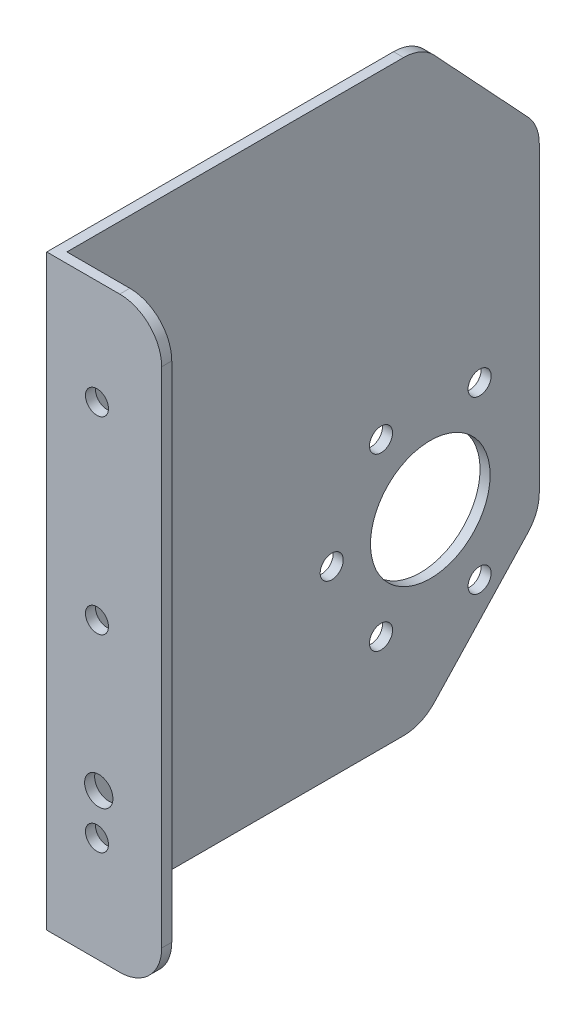
ISO-10303-21;
HEADER;
FILE_DESCRIPTION(('STEP AP214'),'2;1');
FILE_NAME('part.step','',(''),(''),'','','');
FILE_SCHEMA(('AUTOMOTIVE_DESIGN { 1 0 10303 214 1 1 1 1 }'));
ENDSEC;
DATA;
#1=APPLICATION_CONTEXT('core data for automotive mechanical design processes');
#2=APPLICATION_PROTOCOL_DEFINITION('international standard','automotive_design',2000,#1);
#3=PRODUCT_CONTEXT('',#1,'mechanical');
#4=PRODUCT('Part','Part','',(#3));
#5=PRODUCT_RELATED_PRODUCT_CATEGORY('part','',(#4));
#6=PRODUCT_DEFINITION_FORMATION('','',#4);
#7=PRODUCT_DEFINITION_CONTEXT('part definition',#1,'design');
#8=PRODUCT_DEFINITION('design','',#6,#7);
#9=PRODUCT_DEFINITION_SHAPE('','',#8);
#10=(LENGTH_UNIT() NAMED_UNIT(*) SI_UNIT(.MILLI.,.METRE.));
#11=(NAMED_UNIT(*) PLANE_ANGLE_UNIT() SI_UNIT($,.RADIAN.));
#12=(NAMED_UNIT(*) SI_UNIT($,.STERADIAN.) SOLID_ANGLE_UNIT());
#13=UNCERTAINTY_MEASURE_WITH_UNIT(LENGTH_MEASURE(1.E-05),#10,'distance_accuracy_value','');
#14=(GEOMETRIC_REPRESENTATION_CONTEXT(3) GLOBAL_UNCERTAINTY_ASSIGNED_CONTEXT((#13)) GLOBAL_UNIT_ASSIGNED_CONTEXT((#10,
#11,#12)) REPRESENTATION_CONTEXT('',''));
#15=CARTESIAN_POINT('',(0.,0.,0.));
#16=DIRECTION('',(0.,0.,1.));
#17=DIRECTION('',(1.,0.,0.));
#18=AXIS2_PLACEMENT_3D('',#15,#16,#17);
#19=CARTESIAN_POINT('',(2.4,0.,0.));
#20=DIRECTION('',(0.,0.,-1.));
#21=DIRECTION('',(0.,1.,0.));
#22=AXIS2_PLACEMENT_3D('',#19,#20,#21);
#23=PLANE('',#22);
#24=CARTESIAN_POINT('',(12.4,-105.,0.));
#25=DIRECTION('',(0.,0.,1.));
#26=DIRECTION('',(1.,0.,0.));
#27=AXIS2_PLACEMENT_3D('',#24,#25,#26);
#28=CIRCLE('',#27,3.375);
#29=CARTESIAN_POINT('',(15.775,-105.,0.));
#30=VERTEX_POINT('',#29);
#31=EDGE_CURVE('E557',#30,#30,#28,.T.);
#32=ORIENTED_EDGE('',*,*,#31,.F.);
#33=EDGE_LOOP('',(#32));
#34=FACE_BOUND('',#33,.T.);
#35=CARTESIAN_POINT('',(11.9749835807568,-115.,0.));
#36=DIRECTION('',(0.,0.,1.));
#37=DIRECTION('',(1.,0.,0.));
#38=AXIS2_PLACEMENT_3D('',#35,#36,#37);
#39=CIRCLE('',#38,2.75);
#40=CARTESIAN_POINT('',(14.7249835807568,-115.,0.));
#41=VERTEX_POINT('',#40);
#42=EDGE_CURVE('E593',#41,#41,#39,.T.);
#43=ORIENTED_EDGE('',*,*,#42,.F.);
#44=EDGE_LOOP('',(#43));
#45=FACE_BOUND('',#44,.T.);
#46=CARTESIAN_POINT('',(11.9749835807568,-25.,0.));
#47=DIRECTION('',(0.,0.,1.));
#48=DIRECTION('',(1.,0.,0.));
#49=AXIS2_PLACEMENT_3D('',#46,#47,#48);
#50=CIRCLE('',#49,2.75);
#51=CARTESIAN_POINT('',(14.7249835807568,-25.,0.));
#52=VERTEX_POINT('',#51);
#53=EDGE_CURVE('E596',#52,#52,#50,.T.);
#54=ORIENTED_EDGE('',*,*,#53,.F.);
#55=EDGE_LOOP('',(#54));
#56=FACE_BOUND('',#55,.T.);
#57=CARTESIAN_POINT('',(11.9749835807568,-70.,0.));
#58=DIRECTION('',(0.,0.,1.));
#59=DIRECTION('',(1.,0.,0.));
#60=AXIS2_PLACEMENT_3D('',#57,#58,#59);
#61=CIRCLE('',#60,2.75);
#62=CARTESIAN_POINT('',(14.7249835807568,-70.,0.));
#63=VERTEX_POINT('',#62);
#64=EDGE_CURVE('E256',#63,#63,#61,.T.);
#65=ORIENTED_EDGE('',*,*,#64,.F.);
#66=EDGE_LOOP('',(#65));
#67=FACE_BOUND('',#66,.T.);
#68=DIRECTION('',(-1.,0.,0.));
#69=VECTOR('',#68,1.);
#70=CARTESIAN_POINT('',(2.4,-140.,0.));
#71=LINE('',#70,#69);
#72=CARTESIAN_POINT('',(17.4,-140.,0.));
#73=VERTEX_POINT('',#72);
#74=CARTESIAN_POINT('',(0.,-140.,0.));
#75=VERTEX_POINT('',#74);
#76=EDGE_CURVE('E202',#73,#75,#71,.T.);
#77=ORIENTED_EDGE('',*,*,#76,.F.);
#78=CARTESIAN_POINT('',(17.4,-130.,0.));
#79=DIRECTION('',(0.,0.,-1.));
#80=DIRECTION('',(0.,1.,0.));
#81=AXIS2_PLACEMENT_3D('',#78,#79,#80);
#82=CIRCLE('',#81,10.);
#83=CARTESIAN_POINT('',(27.4,-130.,0.));
#84=VERTEX_POINT('',#83);
#85=EDGE_CURVE('E48',#73,#84,#82,.F.);
#86=ORIENTED_EDGE('',*,*,#85,.T.);
#87=DIRECTION('',(0.,-1.,0.));
#88=VECTOR('',#87,1.);
#89=CARTESIAN_POINT('',(27.4,-140.,0.));
#90=LINE('',#89,#88);
#91=CARTESIAN_POINT('',(27.4,-10.,0.));
#92=VERTEX_POINT('',#91);
#93=EDGE_CURVE('E167',#92,#84,#90,.T.);
#94=ORIENTED_EDGE('',*,*,#93,.F.);
#95=CARTESIAN_POINT('',(17.4,-10.,0.));
#96=DIRECTION('',(0.,0.,-1.));
#97=DIRECTION('',(0.,1.,0.));
#98=AXIS2_PLACEMENT_3D('',#95,#96,#97);
#99=CIRCLE('',#98,10.);
#100=CARTESIAN_POINT('',(17.4,0.,0.));
#101=VERTEX_POINT('',#100);
#102=EDGE_CURVE('E57',#92,#101,#99,.F.);
#103=ORIENTED_EDGE('',*,*,#102,.T.);
#104=DIRECTION('',(-1.,0.,0.));
#105=VECTOR('',#104,1.);
#106=CARTESIAN_POINT('',(2.4,0.,0.));
#107=LINE('',#106,#105);
#108=CARTESIAN_POINT('',(0.,0.,0.));
#109=VERTEX_POINT('',#108);
#110=EDGE_CURVE('E161',#101,#109,#107,.T.);
#111=ORIENTED_EDGE('',*,*,#110,.T.);
#112=DIRECTION('',(0.,-1.,0.));
#113=VECTOR('',#112,1.);
#114=CARTESIAN_POINT('',(0.,0.,0.));
#115=LINE('',#114,#113);
#116=EDGE_CURVE('E176',#109,#75,#115,.T.);
#117=ORIENTED_EDGE('',*,*,#116,.T.);
#118=EDGE_LOOP('',(#77,#86,#94,#103,#111,#117));
#119=FACE_BOUND('',#118,.T.);
#120=ADVANCED_FACE('F39',(#34,#45,#56,#67,#119),#23,.F.);
#121=CARTESIAN_POINT('',(2.4,-140.,0.));
#122=DIRECTION('',(0.,1.,0.));
#123=DIRECTION('',(0.,0.,1.));
#124=AXIS2_PLACEMENT_3D('',#121,#122,#123);
#125=PLANE('',#124);
#126=DIRECTION('',(-1.,0.,0.));
#127=VECTOR('',#126,1.);
#128=CARTESIAN_POINT('',(27.4,-140.,-2.4));
#129=LINE('',#128,#127);
#130=CARTESIAN_POINT('',(17.4,-140.,-2.4));
#131=VERTEX_POINT('',#130);
#132=CARTESIAN_POINT('',(2.4,-140.,-2.4));
#133=VERTEX_POINT('',#132);
#134=EDGE_CURVE('E151',#131,#133,#129,.T.);
#135=ORIENTED_EDGE('',*,*,#134,.F.);
#136=DIRECTION('',(0.,0.,-1.));
#137=VECTOR('',#136,1.);
#138=CARTESIAN_POINT('',(17.4,-140.,0.));
#139=LINE('',#138,#137);
#140=EDGE_CURVE('E64',#131,#73,#139,.F.);
#141=ORIENTED_EDGE('',*,*,#140,.T.);
#142=ORIENTED_EDGE('',*,*,#76,.T.);
#143=DIRECTION('',(0.,0.,-1.));
#144=VECTOR('',#143,1.);
#145=CARTESIAN_POINT('',(0.,-140.,0.));
#146=LINE('',#145,#144);
#147=CARTESIAN_POINT('',(0.,-140.,-82.6544769808779));
#148=VERTEX_POINT('',#147);
#149=EDGE_CURVE('E198',#75,#148,#146,.T.);
#150=ORIENTED_EDGE('',*,*,#149,.T.);
#151=DIRECTION('',(1.,0.,0.));
#152=VECTOR('',#151,1.);
#153=CARTESIAN_POINT('',(2.4,-140.,-82.6544769808779));
#154=LINE('',#153,#152);
#155=CARTESIAN_POINT('',(2.4,-140.,-82.6544769808779));
#156=VERTEX_POINT('',#155);
#157=EDGE_CURVE('E210',#148,#156,#154,.T.);
#158=ORIENTED_EDGE('',*,*,#157,.T.);
#159=DIRECTION('',(0.,0.,-1.));
#160=VECTOR('',#159,1.);
#161=CARTESIAN_POINT('',(2.4,-140.,0.));
#162=LINE('',#161,#160);
#163=EDGE_CURVE('E189',#133,#156,#162,.T.);
#164=ORIENTED_EDGE('',*,*,#163,.F.);
#165=EDGE_LOOP('',(#135,#141,#142,#150,#158,#164));
#166=FACE_BOUND('',#165,.T.);
#167=ADVANCED_FACE('F285',(#166),#125,.F.);
#168=CARTESIAN_POINT('',(2.4,0.,-115.));
#169=DIRECTION('',(0.,0.,1.));
#170=DIRECTION('',(0.,-1.,0.));
#171=AXIS2_PLACEMENT_3D('',#168,#169,#170);
#172=PLANE('',#171);
#173=DIRECTION('',(0.,1.,0.));
#174=VECTOR('',#173,1.);
#175=CARTESIAN_POINT('',(2.4,0.,-115.));
#176=LINE('',#175,#174);
#177=CARTESIAN_POINT('',(2.4,-106.058368193798,-115.));
#178=VERTEX_POINT('',#177);
#179=CARTESIAN_POINT('',(2.4,-33.9416318062023,-115.));
#180=VERTEX_POINT('',#179);
#181=EDGE_CURVE('E165',#178,#180,#176,.T.);
#182=ORIENTED_EDGE('',*,*,#181,.F.);
#183=DIRECTION('',(1.,0.,0.));
#184=VECTOR('',#183,1.);
#185=CARTESIAN_POINT('',(2.4,-106.058368193798,-115.));
#186=LINE('',#185,#184);
#187=CARTESIAN_POINT('',(0.,-106.058368193798,-115.));
#188=VERTEX_POINT('',#187);
#189=EDGE_CURVE('E232',#178,#188,#186,.F.);
#190=ORIENTED_EDGE('',*,*,#189,.T.);
#191=DIRECTION('',(0.,1.,0.));
#192=VECTOR('',#191,1.);
#193=CARTESIAN_POINT('',(0.,0.,-115.));
#194=LINE('',#193,#192);
#195=CARTESIAN_POINT('',(0.,-33.9416318062023,-115.));
#196=VERTEX_POINT('',#195);
#197=EDGE_CURVE('E200',#188,#196,#194,.T.);
#198=ORIENTED_EDGE('',*,*,#197,.T.);
#199=DIRECTION('',(1.,0.,0.));
#200=VECTOR('',#199,1.);
#201=CARTESIAN_POINT('',(2.4,-33.9416318062023,-115.));
#202=LINE('',#201,#200);
#203=EDGE_CURVE('E226',#196,#180,#202,.T.);
#204=ORIENTED_EDGE('',*,*,#203,.T.);
#205=EDGE_LOOP('',(#182,#190,#198,#204));
#206=FACE_BOUND('',#205,.T.);
#207=ADVANCED_FACE('F286',(#206),#172,.F.);
#208=CARTESIAN_POINT('',(2.4,0.,0.));
#209=DIRECTION('',(0.,-1.,0.));
#210=DIRECTION('',(0.,0.,-1.));
#211=AXIS2_PLACEMENT_3D('',#208,#209,#210);
#212=PLANE('',#211);
#213=ORIENTED_EDGE('',*,*,#110,.F.);
#214=DIRECTION('',(0.,0.,1.));
#215=VECTOR('',#214,1.);
#216=CARTESIAN_POINT('',(17.4,0.,0.));
#217=LINE('',#216,#215);
#218=CARTESIAN_POINT('',(17.4,0.,-2.4));
#219=VERTEX_POINT('',#218);
#220=EDGE_CURVE('E11',#101,#219,#217,.F.);
#221=ORIENTED_EDGE('',*,*,#220,.T.);
#222=DIRECTION('',(-1.,0.,0.));
#223=VECTOR('',#222,1.);
#224=CARTESIAN_POINT('',(27.4,0.,-2.4));
#225=LINE('',#224,#223);
#226=CARTESIAN_POINT('',(2.4,0.,-2.4));
#227=VERTEX_POINT('',#226);
#228=EDGE_CURVE('E142',#219,#227,#225,.T.);
#229=ORIENTED_EDGE('',*,*,#228,.T.);
#230=DIRECTION('',(0.,0.,1.));
#231=VECTOR('',#230,1.);
#232=CARTESIAN_POINT('',(2.4,0.,0.));
#233=LINE('',#232,#231);
#234=CARTESIAN_POINT('',(2.4,0.,-82.6544769808779));
#235=VERTEX_POINT('',#234);
#236=EDGE_CURVE('E144',#235,#227,#233,.T.);
#237=ORIENTED_EDGE('',*,*,#236,.F.);
#238=DIRECTION('',(1.,0.,0.));
#239=VECTOR('',#238,1.);
#240=CARTESIAN_POINT('',(2.4,0.,-82.6544769808779));
#241=LINE('',#240,#239);
#242=CARTESIAN_POINT('',(0.,0.,-82.6544769808779));
#243=VERTEX_POINT('',#242);
#244=EDGE_CURVE('E238',#235,#243,#241,.F.);
#245=ORIENTED_EDGE('',*,*,#244,.T.);
#246=DIRECTION('',(0.,0.,1.));
#247=VECTOR('',#246,1.);
#248=CARTESIAN_POINT('',(0.,0.,0.));
#249=LINE('',#248,#247);
#250=EDGE_CURVE('E193',#243,#109,#249,.T.);
#251=ORIENTED_EDGE('',*,*,#250,.T.);
#252=EDGE_LOOP('',(#213,#221,#229,#237,#245,#251));
#253=FACE_BOUND('',#252,.T.);
#254=ADVANCED_FACE('F145',(#253),#212,.F.);
#255=CARTESIAN_POINT('',(2.4,0.,0.));
#256=DIRECTION('',(1.,0.,0.));
#257=DIRECTION('',(0.,0.,-1.));
#258=AXIS2_PLACEMENT_3D('',#255,#256,#257);
#259=PLANE('',#258);
#260=CARTESIAN_POINT('',(2.4,-96.4940291992388,-65.5279478035423));
#261=DIRECTION('',(1.,0.,0.));
#262=DIRECTION('',(0.,0.,-1.));
#263=AXIS2_PLACEMENT_3D('',#260,#261,#262);
#264=CIRCLE('',#263,2.75000000000001);
#265=CARTESIAN_POINT('',(2.4,-96.4940291992388,-68.2779478035423));
#266=VERTEX_POINT('',#265);
#267=EDGE_CURVE('E558',#266,#266,#264,.T.);
#268=ORIENTED_EDGE('',*,*,#267,.F.);
#269=EDGE_LOOP('',(#268));
#270=FACE_BOUND('',#269,.T.);
#271=CARTESIAN_POINT('',(2.4,-116.845626188173,-77.2779478035427));
#272=DIRECTION('',(1.,0.,0.));
#273=DIRECTION('',(0.,0.,-1.));
#274=AXIS2_PLACEMENT_3D('',#271,#272,#273);
#275=CIRCLE('',#274,2.75000000000001);
#276=CARTESIAN_POINT('',(2.4,-116.845626188173,-80.0279478035427));
#277=VERTEX_POINT('',#276);
#278=EDGE_CURVE('E582',#277,#277,#275,.T.);
#279=ORIENTED_EDGE('',*,*,#278,.F.);
#280=EDGE_LOOP('',(#279));
#281=FACE_BOUND('',#280,.T.);
#282=CARTESIAN_POINT('',(2.4,-116.845626188173,-100.777947803542));
#283=DIRECTION('',(1.,0.,0.));
#284=DIRECTION('',(0.,0.,-1.));
#285=AXIS2_PLACEMENT_3D('',#282,#283,#284);
#286=CIRCLE('',#285,2.75000000000001);
#287=CARTESIAN_POINT('',(2.4,-116.845626188173,-103.527947803542));
#288=VERTEX_POINT('',#287);
#289=EDGE_CURVE('E578',#288,#288,#286,.T.);
#290=ORIENTED_EDGE('',*,*,#289,.F.);
#291=EDGE_LOOP('',(#290));
#292=FACE_BOUND('',#291,.T.);
#293=CARTESIAN_POINT('',(2.4,-76.1424322103045,-100.777947803542));
#294=DIRECTION('',(1.,0.,0.));
#295=DIRECTION('',(0.,0.,-1.));
#296=AXIS2_PLACEMENT_3D('',#293,#294,#295);
#297=CIRCLE('',#296,2.75);
#298=CARTESIAN_POINT('',(2.4,-76.1424322103045,-103.527947803542));
#299=VERTEX_POINT('',#298);
#300=EDGE_CURVE('E568',#299,#299,#297,.T.);
#301=ORIENTED_EDGE('',*,*,#300,.F.);
#302=EDGE_LOOP('',(#301));
#303=FACE_BOUND('',#302,.T.);
#304=CARTESIAN_POINT('',(2.4,-76.1424322103045,-77.2779478035423));
#305=DIRECTION('',(1.,0.,0.));
#306=DIRECTION('',(0.,0.,-1.));
#307=AXIS2_PLACEMENT_3D('',#304,#305,#306);
#308=CIRCLE('',#307,2.75000000000001);
#309=CARTESIAN_POINT('',(2.4,-76.1424322103045,-80.0279478035423));
#310=VERTEX_POINT('',#309);
#311=EDGE_CURVE('E562',#310,#310,#308,.T.);
#312=ORIENTED_EDGE('',*,*,#311,.F.);
#313=EDGE_LOOP('',(#312));
#314=FACE_BOUND('',#313,.T.);
#315=CARTESIAN_POINT('',(2.4,-96.4940291992383,-89.0279478035427));
#316=DIRECTION('',(1.,0.,0.));
#317=DIRECTION('',(0.,0.,-1.));
#318=AXIS2_PLACEMENT_3D('',#315,#316,#317);
#319=CIRCLE('',#318,14.26);
#320=CARTESIAN_POINT('',(2.4,-96.4940291992383,-103.287947803543));
#321=VERTEX_POINT('',#320);
#322=EDGE_CURVE('E567',#321,#321,#319,.T.);
#323=ORIENTED_EDGE('',*,*,#322,.F.);
#324=EDGE_LOOP('',(#323));
#325=FACE_BOUND('',#324,.T.);
#326=DIRECTION('',(0.,1.,0.));
#327=VECTOR('',#326,1.);
#328=CARTESIAN_POINT('',(2.4,-140.,-2.4));
#329=LINE('',#328,#327);
#330=EDGE_CURVE('E160',#133,#227,#329,.T.);
#331=ORIENTED_EDGE('',*,*,#330,.F.);
#332=ORIENTED_EDGE('',*,*,#163,.T.);
#333=CARTESIAN_POINT('',(2.4,-130.,-82.6544769808779));
#334=DIRECTION('',(1.,0.,0.));
#335=DIRECTION('',(0.,0.,-1.));
#336=AXIS2_PLACEMENT_3D('',#333,#334,#335);
#337=CIRCLE('',#336,10.);
#338=CARTESIAN_POINT('',(2.4,-136.8231825036,-89.9650296633066));
#339=VERTEX_POINT('',#338);
#340=EDGE_CURVE('E214',#156,#339,#337,.T.);
#341=ORIENTED_EDGE('',*,*,#340,.T.);
#342=DIRECTION('',(0.,-0.731055268242869,0.682318250360011));
#343=VECTOR('',#342,1.);
#344=CARTESIAN_POINT('',(2.4,-110.,-115.));
#345=LINE('',#344,#343);
#346=CARTESIAN_POINT('',(2.4,-112.881550697398,-112.310552682429));
#347=VERTEX_POINT('',#346);
#348=EDGE_CURVE('E184',#347,#339,#345,.T.);
#349=ORIENTED_EDGE('',*,*,#348,.F.);
#350=CARTESIAN_POINT('',(2.4,-106.058368193798,-105.));
#351=DIRECTION('',(1.,0.,0.));
#352=DIRECTION('',(0.,0.,-1.));
#353=AXIS2_PLACEMENT_3D('',#350,#351,#352);
#354=CIRCLE('',#353,10.);
#355=EDGE_CURVE('E213',#347,#178,#354,.T.);
#356=ORIENTED_EDGE('',*,*,#355,.T.);
#357=ORIENTED_EDGE('',*,*,#181,.T.);
#358=CARTESIAN_POINT('',(2.4,-33.9416318062023,-105.));
#359=DIRECTION('',(1.,0.,0.));
#360=DIRECTION('',(0.,0.,-1.));
#361=AXIS2_PLACEMENT_3D('',#358,#359,#360);
#362=CIRCLE('',#361,10.);
#363=CARTESIAN_POINT('',(2.4,-27.1184493026022,-112.310552682429));
#364=VERTEX_POINT('',#363);
#365=EDGE_CURVE('E211',#180,#364,#362,.T.);
#366=ORIENTED_EDGE('',*,*,#365,.T.);
#367=DIRECTION('',(0.,-0.731055268242869,-0.682318250360012));
#368=VECTOR('',#367,1.);
#369=CARTESIAN_POINT('',(2.4,0.,-87.));
#370=LINE('',#369,#368);
#371=CARTESIAN_POINT('',(2.4,-3.17681749639988,-89.9650296633066));
#372=VERTEX_POINT('',#371);
#373=EDGE_CURVE('E182',#372,#364,#370,.T.);
#374=ORIENTED_EDGE('',*,*,#373,.F.);
#375=CARTESIAN_POINT('',(2.4,-10.,-82.6544769808779));
#376=DIRECTION('',(1.,0.,0.));
#377=DIRECTION('',(0.,0.,-1.));
#378=AXIS2_PLACEMENT_3D('',#375,#376,#377);
#379=CIRCLE('',#378,10.);
#380=EDGE_CURVE('E159',#372,#235,#379,.T.);
#381=ORIENTED_EDGE('',*,*,#380,.T.);
#382=ORIENTED_EDGE('',*,*,#236,.T.);
#383=EDGE_LOOP('',(#331,#332,#341,#349,#356,#357,#366,#374,#381,#382));
#384=FACE_BOUND('',#383,.T.);
#385=ADVANCED_FACE('F156',(#270,#281,#292,#303,#314,#325,#384),#259,.T.);
#386=CARTESIAN_POINT('',(0.,0.,0.));
#387=DIRECTION('',(1.,0.,0.));
#388=DIRECTION('',(0.,0.,-1.));
#389=AXIS2_PLACEMENT_3D('',#386,#387,#388);
#390=PLANE('',#389);
#391=CARTESIAN_POINT('',(0.,-96.4940291992388,-65.5279478035423));
#392=DIRECTION('',(1.,0.,0.));
#393=DIRECTION('',(0.,0.,-1.));
#394=AXIS2_PLACEMENT_3D('',#391,#392,#393);
#395=CIRCLE('',#394,2.75000000000001);
#396=CARTESIAN_POINT('',(0.,-96.4940291992388,-68.2779478035423));
#397=VERTEX_POINT('',#396);
#398=EDGE_CURVE('E553',#397,#397,#395,.T.);
#399=ORIENTED_EDGE('',*,*,#398,.T.);
#400=EDGE_LOOP('',(#399));
#401=FACE_BOUND('',#400,.T.);
#402=CARTESIAN_POINT('',(0.,-116.845626188173,-77.2779478035427));
#403=DIRECTION('',(1.,0.,0.));
#404=DIRECTION('',(0.,0.,-1.));
#405=AXIS2_PLACEMENT_3D('',#402,#403,#404);
#406=CIRCLE('',#405,2.75000000000001);
#407=CARTESIAN_POINT('',(0.,-116.845626188173,-80.0279478035427));
#408=VERTEX_POINT('',#407);
#409=EDGE_CURVE('E584',#408,#408,#406,.T.);
#410=ORIENTED_EDGE('',*,*,#409,.T.);
#411=EDGE_LOOP('',(#410));
#412=FACE_BOUND('',#411,.T.);
#413=CARTESIAN_POINT('',(0.,-116.845626188173,-100.777947803542));
#414=DIRECTION('',(1.,0.,0.));
#415=DIRECTION('',(0.,0.,-1.));
#416=AXIS2_PLACEMENT_3D('',#413,#414,#415);
#417=CIRCLE('',#416,2.75000000000001);
#418=CARTESIAN_POINT('',(0.,-116.845626188173,-103.527947803542));
#419=VERTEX_POINT('',#418);
#420=EDGE_CURVE('E580',#419,#419,#417,.T.);
#421=ORIENTED_EDGE('',*,*,#420,.T.);
#422=EDGE_LOOP('',(#421));
#423=FACE_BOUND('',#422,.T.);
#424=CARTESIAN_POINT('',(0.,-76.1424322103045,-100.777947803542));
#425=DIRECTION('',(1.,0.,0.));
#426=DIRECTION('',(0.,0.,-1.));
#427=AXIS2_PLACEMENT_3D('',#424,#425,#426);
#428=CIRCLE('',#427,2.75);
#429=CARTESIAN_POINT('',(0.,-76.1424322103045,-103.527947803542));
#430=VERTEX_POINT('',#429);
#431=EDGE_CURVE('E573',#430,#430,#428,.T.);
#432=ORIENTED_EDGE('',*,*,#431,.T.);
#433=EDGE_LOOP('',(#432));
#434=FACE_BOUND('',#433,.T.);
#435=CARTESIAN_POINT('',(0.,-76.1424322103045,-77.2779478035423));
#436=DIRECTION('',(1.,0.,0.));
#437=DIRECTION('',(0.,0.,-1.));
#438=AXIS2_PLACEMENT_3D('',#435,#436,#437);
#439=CIRCLE('',#438,2.75000000000001);
#440=CARTESIAN_POINT('',(0.,-76.1424322103045,-80.0279478035423));
#441=VERTEX_POINT('',#440);
#442=EDGE_CURVE('E570',#441,#441,#439,.T.);
#443=ORIENTED_EDGE('',*,*,#442,.T.);
#444=EDGE_LOOP('',(#443));
#445=FACE_BOUND('',#444,.T.);
#446=CARTESIAN_POINT('',(0.,-96.4940291992383,-89.0279478035427));
#447=DIRECTION('',(1.,0.,0.));
#448=DIRECTION('',(0.,0.,-1.));
#449=AXIS2_PLACEMENT_3D('',#446,#447,#448);
#450=CIRCLE('',#449,14.26);
#451=CARTESIAN_POINT('',(0.,-96.4940291992383,-103.287947803543));
#452=VERTEX_POINT('',#451);
#453=EDGE_CURVE('E587',#452,#452,#450,.T.);
#454=ORIENTED_EDGE('',*,*,#453,.T.);
#455=EDGE_LOOP('',(#454));
#456=FACE_BOUND('',#455,.T.);
#457=DIRECTION('',(0.,-0.731055268242869,0.682318250360011));
#458=VECTOR('',#457,1.);
#459=CARTESIAN_POINT('',(0.,-110.,-115.));
#460=LINE('',#459,#458);
#461=CARTESIAN_POINT('',(0.,-112.881550697398,-112.310552682429));
#462=VERTEX_POINT('',#461);
#463=CARTESIAN_POINT('',(0.,-136.8231825036,-89.9650296633066));
#464=VERTEX_POINT('',#463);
#465=EDGE_CURVE('E178',#462,#464,#460,.T.);
#466=ORIENTED_EDGE('',*,*,#465,.T.);
#467=CARTESIAN_POINT('',(0.,-130.,-82.6544769808779));
#468=DIRECTION('',(1.,0.,0.));
#469=DIRECTION('',(0.,0.,-1.));
#470=AXIS2_PLACEMENT_3D('',#467,#468,#469);
#471=CIRCLE('',#470,10.);
#472=EDGE_CURVE('E228',#464,#148,#471,.F.);
#473=ORIENTED_EDGE('',*,*,#472,.T.);
#474=ORIENTED_EDGE('',*,*,#149,.F.);
#475=ORIENTED_EDGE('',*,*,#116,.F.);
#476=ORIENTED_EDGE('',*,*,#250,.F.);
#477=CARTESIAN_POINT('',(0.,-10.,-82.6544769808779));
#478=DIRECTION('',(1.,0.,0.));
#479=DIRECTION('',(0.,0.,-1.));
#480=AXIS2_PLACEMENT_3D('',#477,#478,#479);
#481=CIRCLE('',#480,10.);
#482=CARTESIAN_POINT('',(0.,-3.17681749639988,-89.9650296633066));
#483=VERTEX_POINT('',#482);
#484=EDGE_CURVE('E225',#243,#483,#481,.F.);
#485=ORIENTED_EDGE('',*,*,#484,.T.);
#486=DIRECTION('',(0.,-0.731055268242869,-0.682318250360012));
#487=VECTOR('',#486,1.);
#488=CARTESIAN_POINT('',(0.,0.,-87.));
#489=LINE('',#488,#487);
#490=CARTESIAN_POINT('',(0.,-27.1184493026022,-112.310552682429));
#491=VERTEX_POINT('',#490);
#492=EDGE_CURVE('E179',#483,#491,#489,.T.);
#493=ORIENTED_EDGE('',*,*,#492,.T.);
#494=CARTESIAN_POINT('',(0.,-33.9416318062023,-105.));
#495=DIRECTION('',(1.,0.,0.));
#496=DIRECTION('',(0.,0.,-1.));
#497=AXIS2_PLACEMENT_3D('',#494,#495,#496);
#498=CIRCLE('',#497,10.);
#499=EDGE_CURVE('E221',#491,#196,#498,.F.);
#500=ORIENTED_EDGE('',*,*,#499,.T.);
#501=ORIENTED_EDGE('',*,*,#197,.F.);
#502=CARTESIAN_POINT('',(0.,-106.058368193798,-105.));
#503=DIRECTION('',(1.,0.,0.));
#504=DIRECTION('',(0.,0.,-1.));
#505=AXIS2_PLACEMENT_3D('',#502,#503,#504);
#506=CIRCLE('',#505,10.);
#507=EDGE_CURVE('E227',#188,#462,#506,.F.);
#508=ORIENTED_EDGE('',*,*,#507,.T.);
#509=EDGE_LOOP('',(#466,#473,#474,#475,#476,#485,#493,#500,#501,#508));
#510=FACE_BOUND('',#509,.T.);
#511=ADVANCED_FACE('F337',(#401,#412,#423,#434,#445,#456,#510),#390,.F.);
#512=CARTESIAN_POINT('',(0.,0.,-87.));
#513=DIRECTION('',(0.,-0.682318250360011,0.731055268242869));
#514=DIRECTION('',(0.,-0.731055268242869,-0.682318250360012));
#515=AXIS2_PLACEMENT_3D('',#512,#513,#514);
#516=PLANE('',#515);
#517=ORIENTED_EDGE('',*,*,#373,.T.);
#518=DIRECTION('',(1.,0.,0.));
#519=VECTOR('',#518,1.);
#520=CARTESIAN_POINT('',(0.,-27.1184493026021,-112.310552682429));
#521=LINE('',#520,#519);
#522=EDGE_CURVE('E236',#364,#491,#521,.F.);
#523=ORIENTED_EDGE('',*,*,#522,.T.);
#524=ORIENTED_EDGE('',*,*,#492,.F.);
#525=DIRECTION('',(1.,0.,0.));
#526=VECTOR('',#525,1.);
#527=CARTESIAN_POINT('',(0.,-3.17681749639988,-89.9650296633066));
#528=LINE('',#527,#526);
#529=EDGE_CURVE('E231',#483,#372,#528,.T.);
#530=ORIENTED_EDGE('',*,*,#529,.T.);
#531=EDGE_LOOP('',(#517,#523,#524,#530));
#532=FACE_BOUND('',#531,.T.);
#533=ADVANCED_FACE('F350',(#532),#516,.F.);
#534=CARTESIAN_POINT('',(0.,-110.,-115.));
#535=DIRECTION('',(0.,0.682318250360011,0.731055268242869));
#536=DIRECTION('',(0.,-0.731055268242869,0.682318250360011));
#537=AXIS2_PLACEMENT_3D('',#534,#535,#536);
#538=PLANE('',#537);
#539=ORIENTED_EDGE('',*,*,#348,.T.);
#540=DIRECTION('',(1.,0.,0.));
#541=VECTOR('',#540,1.);
#542=CARTESIAN_POINT('',(0.,-136.8231825036,-89.9650296633066));
#543=LINE('',#542,#541);
#544=EDGE_CURVE('E219',#339,#464,#543,.F.);
#545=ORIENTED_EDGE('',*,*,#544,.T.);
#546=ORIENTED_EDGE('',*,*,#465,.F.);
#547=DIRECTION('',(1.,0.,0.));
#548=VECTOR('',#547,1.);
#549=CARTESIAN_POINT('',(0.,-112.881550697398,-112.310552682429));
#550=LINE('',#549,#548);
#551=EDGE_CURVE('E220',#462,#347,#550,.T.);
#552=ORIENTED_EDGE('',*,*,#551,.T.);
#553=EDGE_LOOP('',(#539,#545,#546,#552));
#554=FACE_BOUND('',#553,.T.);
#555=ADVANCED_FACE('F296',(#554),#538,.F.);
#556=CARTESIAN_POINT('',(2.4,-130.,-82.6544769808779));
#557=DIRECTION('',(1.,0.,0.));
#558=DIRECTION('',(0.,0.,-1.));
#559=AXIS2_PLACEMENT_3D('',#556,#557,#558);
#560=CYLINDRICAL_SURFACE('',#559,10.);
#561=ORIENTED_EDGE('',*,*,#472,.F.);
#562=ORIENTED_EDGE('',*,*,#544,.F.);
#563=ORIENTED_EDGE('',*,*,#340,.F.);
#564=ORIENTED_EDGE('',*,*,#157,.F.);
#565=EDGE_LOOP('',(#561,#562,#563,#564));
#566=FACE_BOUND('',#565,.T.);
#567=ADVANCED_FACE('F297',(#566),#560,.T.);
#568=CARTESIAN_POINT('',(0.,-106.058368193798,-105.));
#569=DIRECTION('',(1.,0.,0.));
#570=DIRECTION('',(0.,0.,-1.));
#571=AXIS2_PLACEMENT_3D('',#568,#569,#570);
#572=CYLINDRICAL_SURFACE('',#571,10.);
#573=ORIENTED_EDGE('',*,*,#507,.F.);
#574=ORIENTED_EDGE('',*,*,#189,.F.);
#575=ORIENTED_EDGE('',*,*,#355,.F.);
#576=ORIENTED_EDGE('',*,*,#551,.F.);
#577=EDGE_LOOP('',(#573,#574,#575,#576));
#578=FACE_BOUND('',#577,.T.);
#579=ADVANCED_FACE('F299',(#578),#572,.T.);
#580=CARTESIAN_POINT('',(2.4,-33.9416318062023,-105.));
#581=DIRECTION('',(1.,0.,0.));
#582=DIRECTION('',(0.,0.,-1.));
#583=AXIS2_PLACEMENT_3D('',#580,#581,#582);
#584=CYLINDRICAL_SURFACE('',#583,10.);
#585=ORIENTED_EDGE('',*,*,#499,.F.);
#586=ORIENTED_EDGE('',*,*,#522,.F.);
#587=ORIENTED_EDGE('',*,*,#365,.F.);
#588=ORIENTED_EDGE('',*,*,#203,.F.);
#589=EDGE_LOOP('',(#585,#586,#587,#588));
#590=FACE_BOUND('',#589,.T.);
#591=ADVANCED_FACE('F305',(#590),#584,.T.);
#592=CARTESIAN_POINT('',(0.,-10.,-82.6544769808779));
#593=DIRECTION('',(1.,0.,0.));
#594=DIRECTION('',(0.,0.,-1.));
#595=AXIS2_PLACEMENT_3D('',#592,#593,#594);
#596=CYLINDRICAL_SURFACE('',#595,10.);
#597=ORIENTED_EDGE('',*,*,#484,.F.);
#598=ORIENTED_EDGE('',*,*,#244,.F.);
#599=ORIENTED_EDGE('',*,*,#380,.F.);
#600=ORIENTED_EDGE('',*,*,#529,.F.);
#601=EDGE_LOOP('',(#597,#598,#599,#600));
#602=FACE_BOUND('',#601,.T.);
#603=ADVANCED_FACE('F306',(#602),#596,.T.);
#604=CARTESIAN_POINT('',(27.4,-140.,-2.4));
#605=DIRECTION('',(0.,0.,1.));
#606=DIRECTION('',(1.,0.,0.));
#607=AXIS2_PLACEMENT_3D('',#604,#605,#606);
#608=PLANE('',#607);
#609=CARTESIAN_POINT('',(12.4,-105.,-2.4));
#610=DIRECTION('',(0.,0.,1.));
#611=DIRECTION('',(1.,0.,0.));
#612=AXIS2_PLACEMENT_3D('',#609,#610,#611);
#613=CIRCLE('',#612,3.375);
#614=CARTESIAN_POINT('',(15.775,-105.,-2.4));
#615=VERTEX_POINT('',#614);
#616=EDGE_CURVE('E43',#615,#615,#613,.T.);
#617=ORIENTED_EDGE('',*,*,#616,.T.);
#618=EDGE_LOOP('',(#617));
#619=FACE_BOUND('',#618,.T.);
#620=CARTESIAN_POINT('',(11.9749835807568,-115.,-2.4));
#621=DIRECTION('',(0.,0.,1.));
#622=DIRECTION('',(1.,0.,0.));
#623=AXIS2_PLACEMENT_3D('',#620,#621,#622);
#624=CIRCLE('',#623,2.75);
#625=CARTESIAN_POINT('',(14.7249835807568,-115.,-2.4));
#626=VERTEX_POINT('',#625);
#627=EDGE_CURVE('E170',#626,#626,#624,.T.);
#628=ORIENTED_EDGE('',*,*,#627,.T.);
#629=EDGE_LOOP('',(#628));
#630=FACE_BOUND('',#629,.T.);
#631=CARTESIAN_POINT('',(11.9749835807568,-25.,-2.4));
#632=DIRECTION('',(0.,0.,1.));
#633=DIRECTION('',(1.,0.,0.));
#634=AXIS2_PLACEMENT_3D('',#631,#632,#633);
#635=CIRCLE('',#634,2.75);
#636=CARTESIAN_POINT('',(14.7249835807568,-25.,-2.4));
#637=VERTEX_POINT('',#636);
#638=EDGE_CURVE('E175',#637,#637,#635,.T.);
#639=ORIENTED_EDGE('',*,*,#638,.T.);
#640=EDGE_LOOP('',(#639));
#641=FACE_BOUND('',#640,.T.);
#642=CARTESIAN_POINT('',(11.9749835807568,-70.,-2.4));
#643=DIRECTION('',(0.,0.,1.));
#644=DIRECTION('',(1.,0.,0.));
#645=AXIS2_PLACEMENT_3D('',#642,#643,#644);
#646=CIRCLE('',#645,2.75);
#647=CARTESIAN_POINT('',(14.7249835807568,-70.,-2.4));
#648=VERTEX_POINT('',#647);
#649=EDGE_CURVE('E254',#648,#648,#646,.T.);
#650=ORIENTED_EDGE('',*,*,#649,.T.);
#651=EDGE_LOOP('',(#650));
#652=FACE_BOUND('',#651,.T.);
#653=DIRECTION('',(0.,1.,0.));
#654=VECTOR('',#653,1.);
#655=CARTESIAN_POINT('',(27.4,-140.,-2.4));
#656=LINE('',#655,#654);
#657=CARTESIAN_POINT('',(27.4,-130.,-2.4));
#658=VERTEX_POINT('',#657);
#659=CARTESIAN_POINT('',(27.4,-10.,-2.4));
#660=VERTEX_POINT('',#659);
#661=EDGE_CURVE('E155',#658,#660,#656,.T.);
#662=ORIENTED_EDGE('',*,*,#661,.F.);
#663=CARTESIAN_POINT('',(17.4,-130.,-2.4));
#664=DIRECTION('',(0.,0.,1.));
#665=DIRECTION('',(1.,0.,0.));
#666=AXIS2_PLACEMENT_3D('',#663,#664,#665);
#667=CIRCLE('',#666,10.);
#668=EDGE_CURVE('E246',#658,#131,#667,.F.);
#669=ORIENTED_EDGE('',*,*,#668,.T.);
#670=ORIENTED_EDGE('',*,*,#134,.T.);
#671=ORIENTED_EDGE('',*,*,#330,.T.);
#672=ORIENTED_EDGE('',*,*,#228,.F.);
#673=CARTESIAN_POINT('',(17.4,-10.,-2.4));
#674=DIRECTION('',(0.,0.,1.));
#675=DIRECTION('',(1.,0.,0.));
#676=AXIS2_PLACEMENT_3D('',#673,#674,#675);
#677=CIRCLE('',#676,10.);
#678=EDGE_CURVE('E247',#219,#660,#677,.F.);
#679=ORIENTED_EDGE('',*,*,#678,.T.);
#680=EDGE_LOOP('',(#662,#669,#670,#671,#672,#679));
#681=FACE_BOUND('',#680,.T.);
#682=ADVANCED_FACE('F164',(#619,#630,#641,#652,#681),#608,.F.);
#683=CARTESIAN_POINT('',(27.4,0.,0.));
#684=DIRECTION('',(-1.,0.,0.));
#685=DIRECTION('',(0.,0.,1.));
#686=AXIS2_PLACEMENT_3D('',#683,#684,#685);
#687=PLANE('',#686);
#688=ORIENTED_EDGE('',*,*,#93,.T.);
#689=DIRECTION('',(0.,0.,-1.));
#690=VECTOR('',#689,1.);
#691=CARTESIAN_POINT('',(27.4,-130.,0.));
#692=LINE('',#691,#690);
#693=EDGE_CURVE('E241',#84,#658,#692,.T.);
#694=ORIENTED_EDGE('',*,*,#693,.T.);
#695=ORIENTED_EDGE('',*,*,#661,.T.);
#696=DIRECTION('',(0.,0.,1.));
#697=VECTOR('',#696,1.);
#698=CARTESIAN_POINT('',(27.4,-10.,0.));
#699=LINE('',#698,#697);
#700=EDGE_CURVE('E245',#660,#92,#699,.T.);
#701=ORIENTED_EDGE('',*,*,#700,.T.);
#702=EDGE_LOOP('',(#688,#694,#695,#701));
#703=FACE_BOUND('',#702,.T.);
#704=ADVANCED_FACE('F314',(#703),#687,.F.);
#705=CARTESIAN_POINT('',(17.4,-130.,0.));
#706=DIRECTION('',(0.,0.,-1.));
#707=DIRECTION('',(-1.,0.,0.));
#708=AXIS2_PLACEMENT_3D('',#705,#706,#707);
#709=CYLINDRICAL_SURFACE('',#708,10.);
#710=ORIENTED_EDGE('',*,*,#85,.F.);
#711=ORIENTED_EDGE('',*,*,#140,.F.);
#712=ORIENTED_EDGE('',*,*,#668,.F.);
#713=ORIENTED_EDGE('',*,*,#693,.F.);
#714=EDGE_LOOP('',(#710,#711,#712,#713));
#715=FACE_BOUND('',#714,.T.);
#716=ADVANCED_FACE('F315',(#715),#709,.T.);
#717=CARTESIAN_POINT('',(17.4,-10.,0.));
#718=DIRECTION('',(0.,0.,1.));
#719=DIRECTION('',(1.,0.,0.));
#720=AXIS2_PLACEMENT_3D('',#717,#718,#719);
#721=CYLINDRICAL_SURFACE('',#720,10.);
#722=ORIENTED_EDGE('',*,*,#678,.F.);
#723=ORIENTED_EDGE('',*,*,#220,.F.);
#724=ORIENTED_EDGE('',*,*,#102,.F.);
#725=ORIENTED_EDGE('',*,*,#700,.F.);
#726=EDGE_LOOP('',(#722,#723,#724,#725));
#727=FACE_BOUND('',#726,.T.);
#728=ADVANCED_FACE('F41',(#727),#721,.T.);
#729=CARTESIAN_POINT('',(11.9749835807568,-70.,-115.));
#730=DIRECTION('',(0.,0.,1.));
#731=DIRECTION('',(1.,0.,0.));
#732=AXIS2_PLACEMENT_3D('',#729,#730,#731);
#733=CYLINDRICAL_SURFACE('',#732,2.75);
#734=ORIENTED_EDGE('',*,*,#64,.T.);
#735=EDGE_LOOP('',(#734));
#736=FACE_BOUND('',#735,.T.);
#737=ORIENTED_EDGE('',*,*,#649,.F.);
#738=EDGE_LOOP('',(#737));
#739=FACE_BOUND('',#738,.T.);
#740=ADVANCED_FACE('F270',(#736,#739),#733,.F.);
#741=CARTESIAN_POINT('',(11.9749835807568,-25.,-115.));
#742=DIRECTION('',(0.,0.,1.));
#743=DIRECTION('',(1.,0.,0.));
#744=AXIS2_PLACEMENT_3D('',#741,#742,#743);
#745=CYLINDRICAL_SURFACE('',#744,2.75);
#746=ORIENTED_EDGE('',*,*,#53,.T.);
#747=EDGE_LOOP('',(#746));
#748=FACE_BOUND('',#747,.T.);
#749=ORIENTED_EDGE('',*,*,#638,.F.);
#750=EDGE_LOOP('',(#749));
#751=FACE_BOUND('',#750,.T.);
#752=ADVANCED_FACE('F262',(#748,#751),#745,.F.);
#753=CARTESIAN_POINT('',(11.9749835807568,-115.,-115.));
#754=DIRECTION('',(0.,0.,1.));
#755=DIRECTION('',(1.,0.,0.));
#756=AXIS2_PLACEMENT_3D('',#753,#754,#755);
#757=CYLINDRICAL_SURFACE('',#756,2.75);
#758=ORIENTED_EDGE('',*,*,#42,.T.);
#759=EDGE_LOOP('',(#758));
#760=FACE_BOUND('',#759,.T.);
#761=ORIENTED_EDGE('',*,*,#627,.F.);
#762=EDGE_LOOP('',(#761));
#763=FACE_BOUND('',#762,.T.);
#764=ADVANCED_FACE('F266',(#760,#763),#757,.F.);
#765=CARTESIAN_POINT('',(0.,-96.4940291992383,-89.0279478035427));
#766=DIRECTION('',(1.,0.,0.));
#767=DIRECTION('',(0.,0.,-1.));
#768=AXIS2_PLACEMENT_3D('',#765,#766,#767);
#769=CYLINDRICAL_SURFACE('',#768,14.26);
#770=ORIENTED_EDGE('',*,*,#453,.F.);
#771=EDGE_LOOP('',(#770));
#772=FACE_BOUND('',#771,.T.);
#773=ORIENTED_EDGE('',*,*,#322,.T.);
#774=EDGE_LOOP('',(#773));
#775=FACE_BOUND('',#774,.T.);
#776=ADVANCED_FACE('F273',(#772,#775),#769,.F.);
#777=CARTESIAN_POINT('',(0.,-76.1424322103045,-77.2779478035423));
#778=DIRECTION('',(1.,0.,0.));
#779=DIRECTION('',(0.,0.,-1.));
#780=AXIS2_PLACEMENT_3D('',#777,#778,#779);
#781=CYLINDRICAL_SURFACE('',#780,2.75000000000001);
#782=ORIENTED_EDGE('',*,*,#442,.F.);
#783=EDGE_LOOP('',(#782));
#784=FACE_BOUND('',#783,.T.);
#785=ORIENTED_EDGE('',*,*,#311,.T.);
#786=EDGE_LOOP('',(#785));
#787=FACE_BOUND('',#786,.T.);
#788=ADVANCED_FACE('F486',(#784,#787),#781,.F.);
#789=CARTESIAN_POINT('',(0.,-76.1424322103045,-100.777947803542));
#790=DIRECTION('',(1.,0.,0.));
#791=DIRECTION('',(0.,0.,-1.));
#792=AXIS2_PLACEMENT_3D('',#789,#790,#791);
#793=CYLINDRICAL_SURFACE('',#792,2.75);
#794=ORIENTED_EDGE('',*,*,#431,.F.);
#795=EDGE_LOOP('',(#794));
#796=FACE_BOUND('',#795,.T.);
#797=ORIENTED_EDGE('',*,*,#300,.T.);
#798=EDGE_LOOP('',(#797));
#799=FACE_BOUND('',#798,.T.);
#800=ADVANCED_FACE('F494',(#796,#799),#793,.F.);
#801=CARTESIAN_POINT('',(0.,-116.845626188173,-100.777947803542));
#802=DIRECTION('',(1.,0.,0.));
#803=DIRECTION('',(0.,0.,-1.));
#804=AXIS2_PLACEMENT_3D('',#801,#802,#803);
#805=CYLINDRICAL_SURFACE('',#804,2.75000000000001);
#806=ORIENTED_EDGE('',*,*,#420,.F.);
#807=EDGE_LOOP('',(#806));
#808=FACE_BOUND('',#807,.T.);
#809=ORIENTED_EDGE('',*,*,#289,.T.);
#810=EDGE_LOOP('',(#809));
#811=FACE_BOUND('',#810,.T.);
#812=ADVANCED_FACE('F501',(#808,#811),#805,.F.);
#813=CARTESIAN_POINT('',(0.,-116.845626188173,-77.2779478035427));
#814=DIRECTION('',(1.,0.,0.));
#815=DIRECTION('',(0.,0.,-1.));
#816=AXIS2_PLACEMENT_3D('',#813,#814,#815);
#817=CYLINDRICAL_SURFACE('',#816,2.75000000000001);
#818=ORIENTED_EDGE('',*,*,#409,.F.);
#819=EDGE_LOOP('',(#818));
#820=FACE_BOUND('',#819,.T.);
#821=ORIENTED_EDGE('',*,*,#278,.T.);
#822=EDGE_LOOP('',(#821));
#823=FACE_BOUND('',#822,.T.);
#824=ADVANCED_FACE('F513',(#820,#823),#817,.F.);
#825=CARTESIAN_POINT('',(0.,-96.4940291992388,-65.5279478035423));
#826=DIRECTION('',(1.,0.,0.));
#827=DIRECTION('',(0.,0.,-1.));
#828=AXIS2_PLACEMENT_3D('',#825,#826,#827);
#829=CYLINDRICAL_SURFACE('',#828,2.75000000000001);
#830=ORIENTED_EDGE('',*,*,#398,.F.);
#831=EDGE_LOOP('',(#830));
#832=FACE_BOUND('',#831,.T.);
#833=ORIENTED_EDGE('',*,*,#267,.T.);
#834=EDGE_LOOP('',(#833));
#835=FACE_BOUND('',#834,.T.);
#836=ADVANCED_FACE('F521',(#832,#835),#829,.F.);
#837=CARTESIAN_POINT('',(12.4,-105.,-115.));
#838=DIRECTION('',(0.,0.,1.));
#839=DIRECTION('',(1.,0.,0.));
#840=AXIS2_PLACEMENT_3D('',#837,#838,#839);
#841=CYLINDRICAL_SURFACE('',#840,3.375);
#842=ORIENTED_EDGE('',*,*,#31,.T.);
#843=EDGE_LOOP('',(#842));
#844=FACE_BOUND('',#843,.T.);
#845=ORIENTED_EDGE('',*,*,#616,.F.);
#846=EDGE_LOOP('',(#845));
#847=FACE_BOUND('',#846,.T.);
#848=ADVANCED_FACE('F534',(#844,#847),#841,.F.);
#849=CLOSED_SHELL('',(#120,#167,#207,#254,#385,#511,#533,#555,#567,#579,#591,#603,#682,#704,
#716,#728,#740,#752,#764,#776,#788,#800,#812,#824,#836,#848));
#850=MANIFOLD_SOLID_BREP('B2',#849);
#851=ADVANCED_BREP_SHAPE_REPRESENTATION('',(#18,#850),#14);
#852=SHAPE_DEFINITION_REPRESENTATION(#9,#851);
ENDSEC;
END-ISO-10303-21;
